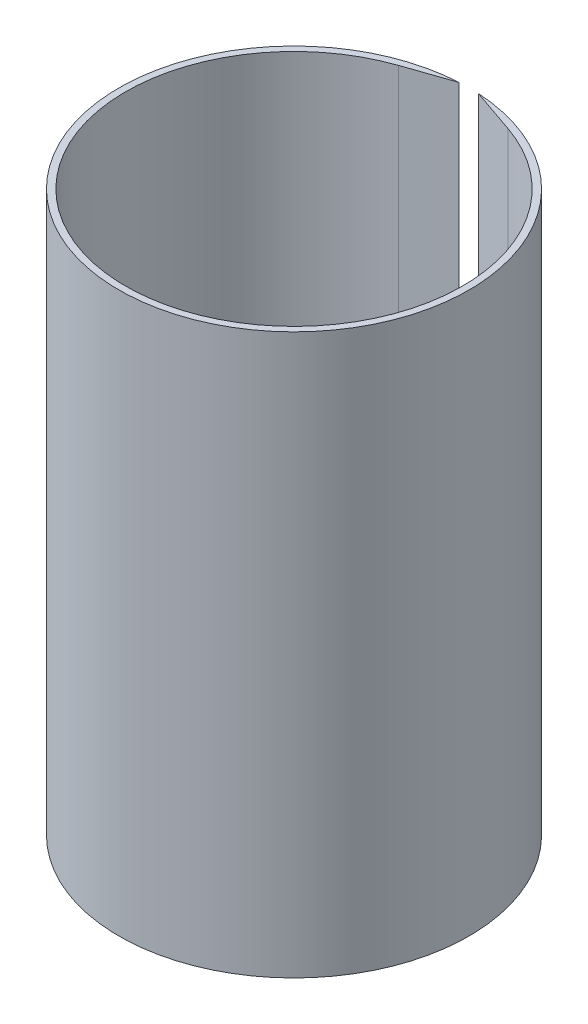
ISO-10303-21;
HEADER;
FILE_DESCRIPTION(('STEP AP214'),'2;1');
FILE_NAME('part.step','',(''),(''),'','','');
FILE_SCHEMA(('AUTOMOTIVE_DESIGN { 1 0 10303 214 1 1 1 1 }'));
ENDSEC;
DATA;
#1=APPLICATION_CONTEXT('core data for automotive mechanical design processes');
#2=APPLICATION_PROTOCOL_DEFINITION('international standard','automotive_design',2000,#1);
#3=PRODUCT_CONTEXT('',#1,'mechanical');
#4=PRODUCT('Part','Part','',(#3));
#5=PRODUCT_RELATED_PRODUCT_CATEGORY('part','',(#4));
#6=PRODUCT_DEFINITION_FORMATION('','',#4);
#7=PRODUCT_DEFINITION_CONTEXT('part definition',#1,'design');
#8=PRODUCT_DEFINITION('design','',#6,#7);
#9=PRODUCT_DEFINITION_SHAPE('','',#8);
#10=(LENGTH_UNIT() NAMED_UNIT(*) SI_UNIT(.MILLI.,.METRE.));
#11=(NAMED_UNIT(*) PLANE_ANGLE_UNIT() SI_UNIT($,.RADIAN.));
#12=(NAMED_UNIT(*) SI_UNIT($,.STERADIAN.) SOLID_ANGLE_UNIT());
#13=UNCERTAINTY_MEASURE_WITH_UNIT(LENGTH_MEASURE(1.E-05),#10,'distance_accuracy_value','');
#14=(GEOMETRIC_REPRESENTATION_CONTEXT(3) GLOBAL_UNCERTAINTY_ASSIGNED_CONTEXT((#13)) GLOBAL_UNIT_ASSIGNED_CONTEXT((#10,
#11,#12)) REPRESENTATION_CONTEXT('',''));
#15=CARTESIAN_POINT('',(0.,0.,0.));
#16=DIRECTION('',(0.,0.,1.));
#17=DIRECTION('',(1.,0.,0.));
#18=AXIS2_PLACEMENT_3D('',#15,#16,#17);
#19=CARTESIAN_POINT('',(0.,133.35,0.));
#20=DIRECTION('',(0.,-1.,0.));
#21=DIRECTION('',(0.,0.,-1.));
#22=AXIS2_PLACEMENT_3D('',#19,#20,#21);
#23=CYLINDRICAL_SURFACE('',#22,40.132);
#24=CARTESIAN_POINT('',(0.,0.,0.));
#25=DIRECTION('',(0.,-1.,0.));
#26=DIRECTION('',(0.,0.,1.));
#27=AXIS2_PLACEMENT_3D('',#24,#25,#26);
#28=CIRCLE('',#27,40.132);
#29=CARTESIAN_POINT('',(13.023686949926,0.,-37.9599921263207));
#30=VERTEX_POINT('',#29);
#31=CARTESIAN_POINT('',(-13.0641984436746,0.,-37.9460688744472));
#32=VERTEX_POINT('',#31);
#33=EDGE_CURVE('E96',#30,#32,#28,.T.);
#34=ORIENTED_EDGE('',*,*,#33,.T.);
#35=DIRECTION('',(0.,-1.,0.));
#36=VECTOR('',#35,1.);
#37=CARTESIAN_POINT('',(-13.0641984436746,133.35,-37.9460688744472));
#38=LINE('',#37,#36);
#39=CARTESIAN_POINT('',(-13.0641984436746,133.35,-37.9460688744472));
#40=VERTEX_POINT('',#39);
#41=EDGE_CURVE('E11',#40,#32,#38,.T.);
#42=ORIENTED_EDGE('',*,*,#41,.F.);
#43=CARTESIAN_POINT('',(0.,133.35,0.));
#44=DIRECTION('',(0.,-1.,0.));
#45=DIRECTION('',(0.,0.,1.));
#46=AXIS2_PLACEMENT_3D('',#43,#44,#45);
#47=CIRCLE('',#46,40.132);
#48=CARTESIAN_POINT('',(13.023686949926,133.35,-37.9599921263207));
#49=VERTEX_POINT('',#48);
#50=EDGE_CURVE('E84',#49,#40,#47,.T.);
#51=ORIENTED_EDGE('',*,*,#50,.F.);
#52=DIRECTION('',(0.,-1.,0.));
#53=VECTOR('',#52,1.);
#54=CARTESIAN_POINT('',(13.023686949926,133.35,-37.9599921263207));
#55=LINE('',#54,#53);
#56=EDGE_CURVE('E92',#49,#30,#55,.T.);
#57=ORIENTED_EDGE('',*,*,#56,.T.);
#58=EDGE_LOOP('',(#34,#42,#51,#57));
#59=FACE_BOUND('',#58,.T.);
#60=ADVANCED_FACE('F33',(#59),#23,.F.);
#61=CARTESIAN_POINT('',(-2.286,133.35,-41.6568227815084));
#62=DIRECTION('',(-0.325530709749691,0.,-0.945531468016725));
#63=DIRECTION('',(-0.945531468016725,0.,0.325530709749691));
#64=AXIS2_PLACEMENT_3D('',#61,#62,#63);
#65=PLANE('',#64);
#66=DIRECTION('',(0.945531468016725,0.,-0.325530709749691));
#67=VECTOR('',#66,1.);
#68=CARTESIAN_POINT('',(-2.286,0.,-41.6568227815084));
#69=LINE('',#68,#67);
#70=CARTESIAN_POINT('',(-2.286,0.,-41.6568227815084));
#71=VERTEX_POINT('',#70);
#72=EDGE_CURVE('E88',#32,#71,#69,.T.);
#73=ORIENTED_EDGE('',*,*,#72,.T.);
#74=DIRECTION('',(0.,-1.,0.));
#75=VECTOR('',#74,1.);
#76=CARTESIAN_POINT('',(-2.286,133.35,-41.6568227815084));
#77=LINE('',#76,#75);
#78=CARTESIAN_POINT('',(-2.286,133.35,-41.6568227815084));
#79=VERTEX_POINT('',#78);
#80=EDGE_CURVE('E41',#79,#71,#77,.T.);
#81=ORIENTED_EDGE('',*,*,#80,.F.);
#82=DIRECTION('',(0.945531468016725,0.,-0.325530709749691));
#83=VECTOR('',#82,1.);
#84=CARTESIAN_POINT('',(-2.286,133.35,-41.6568227815084));
#85=LINE('',#84,#83);
#86=EDGE_CURVE('E79',#40,#79,#85,.T.);
#87=ORIENTED_EDGE('',*,*,#86,.F.);
#88=ORIENTED_EDGE('',*,*,#41,.T.);
#89=EDGE_LOOP('',(#73,#81,#87,#88));
#90=FACE_BOUND('',#89,.T.);
#91=ADVANCED_FACE('F87',(#90),#65,.F.);
#92=CARTESIAN_POINT('',(0.,133.35,0.));
#93=DIRECTION('',(0.,-1.,0.));
#94=DIRECTION('',(0.,0.,-1.));
#95=AXIS2_PLACEMENT_3D('',#92,#93,#94);
#96=CYLINDRICAL_SURFACE('',#95,41.7195);
#97=CARTESIAN_POINT('',(0.,0.,0.));
#98=DIRECTION('',(0.,1.,0.));
#99=DIRECTION('',(0.,0.,1.));
#100=AXIS2_PLACEMENT_3D('',#97,#98,#99);
#101=CIRCLE('',#100,41.7195);
#102=CARTESIAN_POINT('',(2.286,0.,-41.6568227815084));
#103=VERTEX_POINT('',#102);
#104=EDGE_CURVE('E66',#71,#103,#101,.T.);
#105=ORIENTED_EDGE('',*,*,#104,.T.);
#106=DIRECTION('',(0.,-1.,0.));
#107=VECTOR('',#106,1.);
#108=CARTESIAN_POINT('',(2.286,133.35,-41.6568227815084));
#109=LINE('',#108,#107);
#110=CARTESIAN_POINT('',(2.286,133.35,-41.6568227815084));
#111=VERTEX_POINT('',#110);
#112=EDGE_CURVE('E89',#111,#103,#109,.T.);
#113=ORIENTED_EDGE('',*,*,#112,.F.);
#114=CARTESIAN_POINT('',(0.,133.35,0.));
#115=DIRECTION('',(0.,1.,0.));
#116=DIRECTION('',(0.,0.,1.));
#117=AXIS2_PLACEMENT_3D('',#114,#115,#116);
#118=CIRCLE('',#117,41.7195);
#119=EDGE_CURVE('E82',#79,#111,#118,.T.);
#120=ORIENTED_EDGE('',*,*,#119,.F.);
#121=ORIENTED_EDGE('',*,*,#80,.T.);
#122=EDGE_LOOP('',(#105,#113,#120,#121));
#123=FACE_BOUND('',#122,.T.);
#124=ADVANCED_FACE('F90',(#123),#96,.T.);
#125=CARTESIAN_POINT('',(2.286,133.35,-41.6568227815084));
#126=DIRECTION('',(0.325532613303086,0.,-0.945530812652905));
#127=DIRECTION('',(-0.945530812652905,0.,-0.325532613303086));
#128=AXIS2_PLACEMENT_3D('',#125,#126,#127);
#129=PLANE('',#128);
#130=DIRECTION('',(0.945530812652905,0.,0.325532613303086));
#131=VECTOR('',#130,1.);
#132=CARTESIAN_POINT('',(2.286,0.,-41.6568227815084));
#133=LINE('',#132,#131);
#134=EDGE_CURVE('E72',#103,#30,#133,.T.);
#135=ORIENTED_EDGE('',*,*,#134,.T.);
#136=ORIENTED_EDGE('',*,*,#56,.F.);
#137=DIRECTION('',(0.945530812652905,0.,0.325532613303086));
#138=VECTOR('',#137,1.);
#139=CARTESIAN_POINT('',(2.286,133.35,-41.6568227815084));
#140=LINE('',#139,#138);
#141=EDGE_CURVE('E49',#111,#49,#140,.T.);
#142=ORIENTED_EDGE('',*,*,#141,.F.);
#143=ORIENTED_EDGE('',*,*,#112,.T.);
#144=EDGE_LOOP('',(#135,#136,#142,#143));
#145=FACE_BOUND('',#144,.T.);
#146=ADVANCED_FACE('F103',(#145),#129,.F.);
#147=CARTESIAN_POINT('',(0.,133.35,0.));
#148=DIRECTION('',(0.,1.,0.));
#149=DIRECTION('',(0.,0.,1.));
#150=AXIS2_PLACEMENT_3D('',#147,#148,#149);
#151=PLANE('',#150);
#152=ORIENTED_EDGE('',*,*,#50,.T.);
#153=ORIENTED_EDGE('',*,*,#86,.T.);
#154=ORIENTED_EDGE('',*,*,#119,.T.);
#155=ORIENTED_EDGE('',*,*,#141,.T.);
#156=EDGE_LOOP('',(#152,#153,#154,#155));
#157=FACE_BOUND('',#156,.T.);
#158=ADVANCED_FACE('F80',(#157),#151,.T.);
#159=CARTESIAN_POINT('',(0.,0.,0.));
#160=DIRECTION('',(0.,1.,0.));
#161=DIRECTION('',(0.,0.,1.));
#162=AXIS2_PLACEMENT_3D('',#159,#160,#161);
#163=PLANE('',#162);
#164=ORIENTED_EDGE('',*,*,#33,.F.);
#165=ORIENTED_EDGE('',*,*,#134,.F.);
#166=ORIENTED_EDGE('',*,*,#104,.F.);
#167=ORIENTED_EDGE('',*,*,#72,.F.);
#168=EDGE_LOOP('',(#164,#165,#166,#167));
#169=FACE_BOUND('',#168,.T.);
#170=ADVANCED_FACE('F106',(#169),#163,.F.);
#171=CLOSED_SHELL('',(#60,#91,#124,#146,#158,#170));
#172=MANIFOLD_SOLID_BREP('B2',#171);
#173=ADVANCED_BREP_SHAPE_REPRESENTATION('',(#18,#172),#14);
#174=SHAPE_DEFINITION_REPRESENTATION(#9,#173);
ENDSEC;
END-ISO-10303-21;
